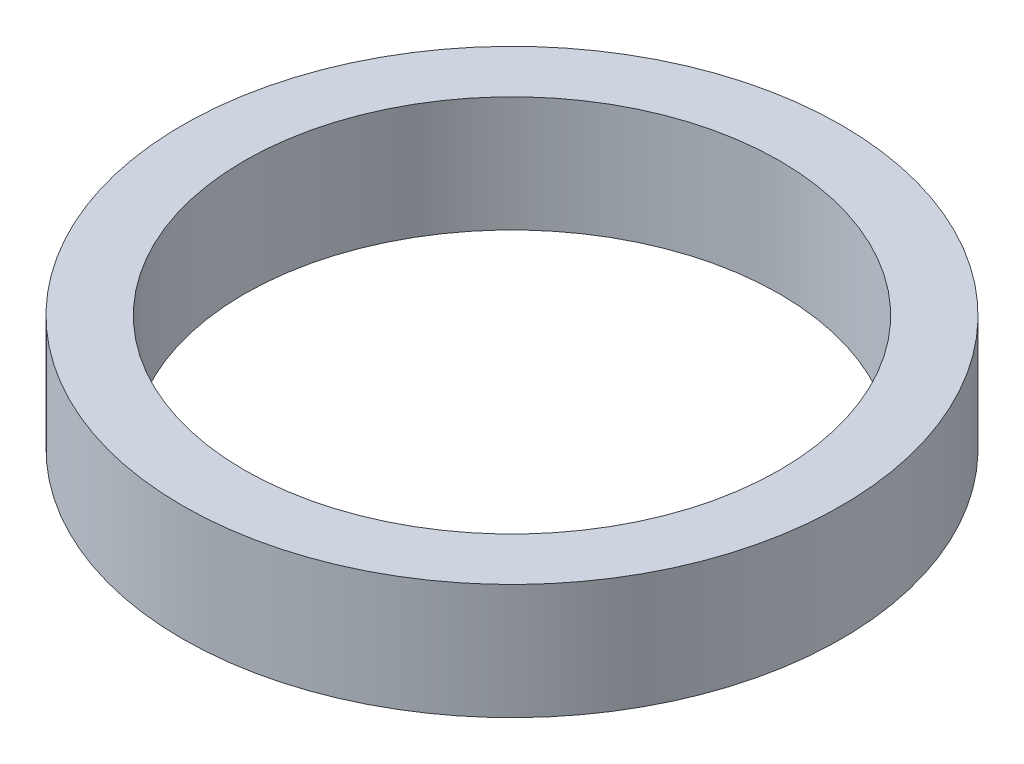
ISO-10303-21;
HEADER;
FILE_DESCRIPTION(('STEP AP214'),'2;1');
FILE_NAME('part.step','',(''),(''),'','','');
FILE_SCHEMA(('AUTOMOTIVE_DESIGN { 1 0 10303 214 1 1 1 1 }'));
ENDSEC;
DATA;
#1=APPLICATION_CONTEXT('core data for automotive mechanical design processes');
#2=APPLICATION_PROTOCOL_DEFINITION('international standard','automotive_design',2000,#1);
#3=PRODUCT_CONTEXT('',#1,'mechanical');
#4=PRODUCT('Part','Part','',(#3));
#5=PRODUCT_RELATED_PRODUCT_CATEGORY('part','',(#4));
#6=PRODUCT_DEFINITION_FORMATION('','',#4);
#7=PRODUCT_DEFINITION_CONTEXT('part definition',#1,'design');
#8=PRODUCT_DEFINITION('design','',#6,#7);
#9=PRODUCT_DEFINITION_SHAPE('','',#8);
#10=(LENGTH_UNIT() NAMED_UNIT(*) SI_UNIT(.MILLI.,.METRE.));
#11=(NAMED_UNIT(*) PLANE_ANGLE_UNIT() SI_UNIT($,.RADIAN.));
#12=(NAMED_UNIT(*) SI_UNIT($,.STERADIAN.) SOLID_ANGLE_UNIT());
#13=UNCERTAINTY_MEASURE_WITH_UNIT(LENGTH_MEASURE(1.E-05),#10,'distance_accuracy_value','');
#14=(GEOMETRIC_REPRESENTATION_CONTEXT(3) GLOBAL_UNCERTAINTY_ASSIGNED_CONTEXT((#13)) GLOBAL_UNIT_ASSIGNED_CONTEXT((#10,
#11,#12)) REPRESENTATION_CONTEXT('',''));
#15=CARTESIAN_POINT('',(0.,0.,0.));
#16=DIRECTION('',(0.,0.,1.));
#17=DIRECTION('',(1.,0.,0.));
#18=AXIS2_PLACEMENT_3D('',#15,#16,#17);
#19=CARTESIAN_POINT('',(0.,14.,0.));
#20=DIRECTION('',(0.,-1.,0.));
#21=DIRECTION('',(0.,0.,-1.));
#22=AXIS2_PLACEMENT_3D('',#19,#20,#21);
#23=CYLINDRICAL_SURFACE('',#22,40.);
#24=CARTESIAN_POINT('',(0.,14.,0.));
#25=DIRECTION('',(0.,1.,0.));
#26=DIRECTION('',(0.,0.,1.));
#27=AXIS2_PLACEMENT_3D('',#24,#25,#26);
#28=CIRCLE('',#27,40.);
#29=CARTESIAN_POINT('',(0.,14.,40.));
#30=VERTEX_POINT('',#29);
#31=EDGE_CURVE('E10',#30,#30,#28,.T.);
#32=ORIENTED_EDGE('',*,*,#31,.F.);
#33=EDGE_LOOP('',(#32));
#34=FACE_BOUND('',#33,.T.);
#35=CARTESIAN_POINT('',(0.,0.,0.));
#36=DIRECTION('',(0.,1.,0.));
#37=DIRECTION('',(0.,0.,1.));
#38=AXIS2_PLACEMENT_3D('',#35,#36,#37);
#39=CIRCLE('',#38,40.);
#40=CARTESIAN_POINT('',(0.,0.,40.));
#41=VERTEX_POINT('',#40);
#42=EDGE_CURVE('E37',#41,#41,#39,.T.);
#43=ORIENTED_EDGE('',*,*,#42,.T.);
#44=EDGE_LOOP('',(#43));
#45=FACE_BOUND('',#44,.T.);
#46=ADVANCED_FACE('F40',(#34,#45),#23,.T.);
#47=CARTESIAN_POINT('',(0.,14.,0.));
#48=DIRECTION('',(0.,1.,0.));
#49=DIRECTION('',(0.,0.,1.));
#50=AXIS2_PLACEMENT_3D('',#47,#48,#49);
#51=PLANE('',#50);
#52=CARTESIAN_POINT('',(0.,14.,0.));
#53=DIRECTION('',(0.,1.,0.));
#54=DIRECTION('',(0.,0.,1.));
#55=AXIS2_PLACEMENT_3D('',#52,#53,#54);
#56=CIRCLE('',#55,32.5);
#57=CARTESIAN_POINT('',(0.,14.,32.5));
#58=VERTEX_POINT('',#57);
#59=EDGE_CURVE('E50',#58,#58,#56,.T.);
#60=ORIENTED_EDGE('',*,*,#59,.F.);
#61=EDGE_LOOP('',(#60));
#62=FACE_BOUND('',#61,.T.);
#63=ORIENTED_EDGE('',*,*,#31,.T.);
#64=EDGE_LOOP('',(#63));
#65=FACE_BOUND('',#64,.T.);
#66=ADVANCED_FACE('F59',(#62,#65),#51,.T.);
#67=CARTESIAN_POINT('',(0.,0.,0.));
#68=DIRECTION('',(0.,1.,0.));
#69=DIRECTION('',(0.,0.,1.));
#70=AXIS2_PLACEMENT_3D('',#67,#68,#69);
#71=PLANE('',#70);
#72=CARTESIAN_POINT('',(0.,0.,0.));
#73=DIRECTION('',(0.,1.,0.));
#74=DIRECTION('',(0.,0.,1.));
#75=AXIS2_PLACEMENT_3D('',#72,#73,#74);
#76=CIRCLE('',#75,32.5);
#77=CARTESIAN_POINT('',(0.,0.,32.5));
#78=VERTEX_POINT('',#77);
#79=EDGE_CURVE('E47',#78,#78,#76,.T.);
#80=ORIENTED_EDGE('',*,*,#79,.T.);
#81=EDGE_LOOP('',(#80));
#82=FACE_BOUND('',#81,.T.);
#83=ORIENTED_EDGE('',*,*,#42,.F.);
#84=EDGE_LOOP('',(#83));
#85=FACE_BOUND('',#84,.T.);
#86=ADVANCED_FACE('F58',(#82,#85),#71,.F.);
#87=CARTESIAN_POINT('',(0.,14.,0.));
#88=DIRECTION('',(0.,-1.,0.));
#89=DIRECTION('',(0.,0.,-1.));
#90=AXIS2_PLACEMENT_3D('',#87,#88,#89);
#91=CYLINDRICAL_SURFACE('',#90,32.5);
#92=ORIENTED_EDGE('',*,*,#59,.T.);
#93=EDGE_LOOP('',(#92));
#94=FACE_BOUND('',#93,.T.);
#95=ORIENTED_EDGE('',*,*,#79,.F.);
#96=EDGE_LOOP('',(#95));
#97=FACE_BOUND('',#96,.T.);
#98=ADVANCED_FACE('F54',(#94,#97),#91,.F.);
#99=CLOSED_SHELL('',(#46,#66,#86,#98));
#100=MANIFOLD_SOLID_BREP('B2',#99);
#101=ADVANCED_BREP_SHAPE_REPRESENTATION('',(#18,#100),#14);
#102=SHAPE_DEFINITION_REPRESENTATION(#9,#101);
ENDSEC;
END-ISO-10303-21;
